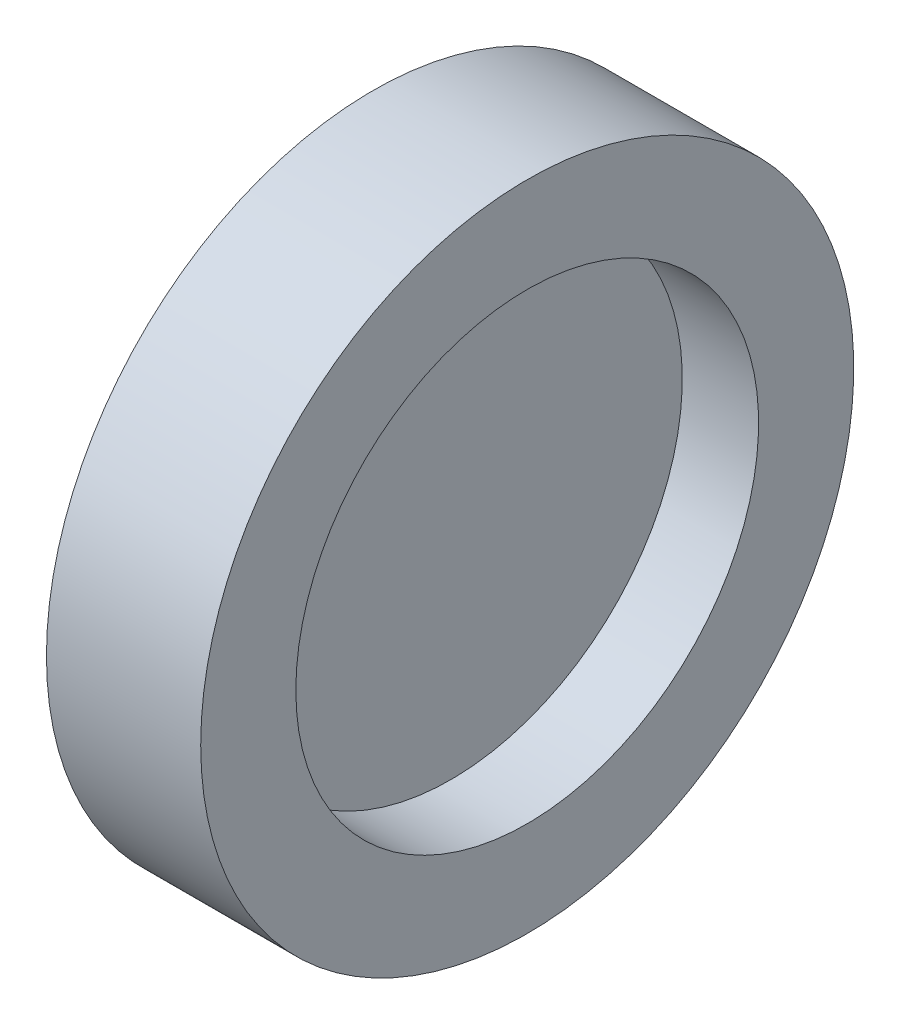
ISO-10303-21;
HEADER;
FILE_DESCRIPTION(('STEP AP214'),'2;1');
FILE_NAME('part.step','',(''),(''),'','','');
FILE_SCHEMA(('AUTOMOTIVE_DESIGN { 1 0 10303 214 1 1 1 1 }'));
ENDSEC;
DATA;
#1=APPLICATION_CONTEXT('core data for automotive mechanical design processes');
#2=APPLICATION_PROTOCOL_DEFINITION('international standard','automotive_design',2000,#1);
#3=PRODUCT_CONTEXT('',#1,'mechanical');
#4=PRODUCT('Part','Part','',(#3));
#5=PRODUCT_RELATED_PRODUCT_CATEGORY('part','',(#4));
#6=PRODUCT_DEFINITION_FORMATION('','',#4);
#7=PRODUCT_DEFINITION_CONTEXT('part definition',#1,'design');
#8=PRODUCT_DEFINITION('design','',#6,#7);
#9=PRODUCT_DEFINITION_SHAPE('','',#8);
#10=(LENGTH_UNIT() NAMED_UNIT(*) SI_UNIT(.MILLI.,.METRE.));
#11=(NAMED_UNIT(*) PLANE_ANGLE_UNIT() SI_UNIT($,.RADIAN.));
#12=(NAMED_UNIT(*) SI_UNIT($,.STERADIAN.) SOLID_ANGLE_UNIT());
#13=UNCERTAINTY_MEASURE_WITH_UNIT(LENGTH_MEASURE(1.E-05),#10,'distance_accuracy_value','');
#14=(GEOMETRIC_REPRESENTATION_CONTEXT(3) GLOBAL_UNCERTAINTY_ASSIGNED_CONTEXT((#13)) GLOBAL_UNIT_ASSIGNED_CONTEXT((#10,
#11,#12)) REPRESENTATION_CONTEXT('',''));
#15=CARTESIAN_POINT('',(0.,0.,0.));
#16=DIRECTION('',(0.,0.,1.));
#17=DIRECTION('',(1.,0.,0.));
#18=AXIS2_PLACEMENT_3D('',#15,#16,#17);
#19=CARTESIAN_POINT('',(0.0305000000000005,9.,0.));
#20=DIRECTION('',(-1.,0.,0.));
#21=DIRECTION('',(0.,0.,1.));
#22=AXIS2_PLACEMENT_3D('',#19,#20,#21);
#23=PLANE('',#22);
#24=CARTESIAN_POINT('',(0.0305000000000011,0.,0.));
#25=DIRECTION('',(-1.,0.,0.));
#26=DIRECTION('',(0.,0.,1.));
#27=AXIS2_PLACEMENT_3D('',#24,#25,#26);
#28=CIRCLE('',#27,9.);
#29=CARTESIAN_POINT('',(0.0305000000000011,0.,9.));
#30=VERTEX_POINT('',#29);
#31=EDGE_CURVE('E10',#30,#30,#28,.T.);
#32=ORIENTED_EDGE('',*,*,#31,.F.);
#33=EDGE_LOOP('',(#32));
#34=FACE_BOUND('',#33,.T.);
#35=ADVANCED_FACE('F37',(#34),#23,.F.);
#36=CARTESIAN_POINT('',(-1.61421241885762,0.,0.));
#37=DIRECTION('',(-1.,0.,0.));
#38=DIRECTION('',(0.,0.,1.));
#39=AXIS2_PLACEMENT_3D('',#36,#37,#38);
#40=CYLINDRICAL_SURFACE('',#39,9.);
#41=CARTESIAN_POINT('',(3.,0.,0.));
#42=DIRECTION('',(-1.,0.,0.));
#43=DIRECTION('',(0.,0.,1.));
#44=AXIS2_PLACEMENT_3D('',#41,#42,#43);
#45=CIRCLE('',#44,9.);
#46=CARTESIAN_POINT('',(3.,0.,9.));
#47=VERTEX_POINT('',#46);
#48=EDGE_CURVE('E60',#47,#47,#45,.T.);
#49=ORIENTED_EDGE('',*,*,#48,.F.);
#50=EDGE_LOOP('',(#49));
#51=FACE_BOUND('',#50,.T.);
#52=ORIENTED_EDGE('',*,*,#31,.T.);
#53=EDGE_LOOP('',(#52));
#54=FACE_BOUND('',#53,.T.);
#55=ADVANCED_FACE('F90',(#51,#54),#40,.F.);
#56=CARTESIAN_POINT('',(-3.,0.,0.));
#57=DIRECTION('',(-1.,0.,0.));
#58=DIRECTION('',(0.,0.,1.));
#59=AXIS2_PLACEMENT_3D('',#56,#57,#58);
#60=CIRCLE('',#59,9.);
#61=CARTESIAN_POINT('',(-3.,0.,9.));
#62=VERTEX_POINT('',#61);
#63=EDGE_CURVE('E64',#62,#62,#60,.T.);
#64=ORIENTED_EDGE('',*,*,#63,.T.);
#65=EDGE_LOOP('',(#64));
#66=FACE_BOUND('',#65,.T.);
#67=CARTESIAN_POINT('',(-0.0305000000000006,0.,0.));
#68=DIRECTION('',(1.,0.,0.));
#69=DIRECTION('',(0.,0.,-1.));
#70=AXIS2_PLACEMENT_3D('',#67,#68,#69);
#71=CIRCLE('',#70,9.);
#72=CARTESIAN_POINT('',(-0.0305000000000006,0.,-9.));
#73=VERTEX_POINT('',#72);
#74=EDGE_CURVE('E44',#73,#73,#71,.T.);
#75=ORIENTED_EDGE('',*,*,#74,.T.);
#76=EDGE_LOOP('',(#75));
#77=FACE_BOUND('',#76,.T.);
#78=ADVANCED_FACE('F69',(#66,#77),#40,.F.);
#79=CARTESIAN_POINT('',(-3.,9.,0.));
#80=DIRECTION('',(1.,0.,0.));
#81=DIRECTION('',(0.,0.,-1.));
#82=AXIS2_PLACEMENT_3D('',#79,#80,#81);
#83=PLANE('',#82);
#84=ORIENTED_EDGE('',*,*,#63,.F.);
#85=EDGE_LOOP('',(#84));
#86=FACE_BOUND('',#85,.T.);
#87=CARTESIAN_POINT('',(-3.,0.,0.));
#88=DIRECTION('',(-1.,0.,0.));
#89=DIRECTION('',(0.,0.,1.));
#90=AXIS2_PLACEMENT_3D('',#87,#88,#89);
#91=CIRCLE('',#90,12.7);
#92=CARTESIAN_POINT('',(-3.,0.,12.7));
#93=VERTEX_POINT('',#92);
#94=EDGE_CURVE('E49',#93,#93,#91,.T.);
#95=ORIENTED_EDGE('',*,*,#94,.T.);
#96=EDGE_LOOP('',(#95));
#97=FACE_BOUND('',#96,.T.);
#98=ADVANCED_FACE('F71',(#86,#97),#83,.F.);
#99=CARTESIAN_POINT('',(-1.61421241885762,0.,0.));
#100=DIRECTION('',(-1.,0.,0.));
#101=DIRECTION('',(0.,0.,1.));
#102=AXIS2_PLACEMENT_3D('',#99,#100,#101);
#103=CYLINDRICAL_SURFACE('',#102,12.7);
#104=ORIENTED_EDGE('',*,*,#94,.F.);
#105=EDGE_LOOP('',(#104));
#106=FACE_BOUND('',#105,.T.);
#107=CARTESIAN_POINT('',(3.,0.,0.));
#108=DIRECTION('',(-1.,0.,0.));
#109=DIRECTION('',(0.,0.,1.));
#110=AXIS2_PLACEMENT_3D('',#107,#108,#109);
#111=CIRCLE('',#110,12.7);
#112=CARTESIAN_POINT('',(3.,0.,12.7));
#113=VERTEX_POINT('',#112);
#114=EDGE_CURVE('E54',#113,#113,#111,.T.);
#115=ORIENTED_EDGE('',*,*,#114,.T.);
#116=EDGE_LOOP('',(#115));
#117=FACE_BOUND('',#116,.T.);
#118=ADVANCED_FACE('F74',(#106,#117),#103,.T.);
#119=CARTESIAN_POINT('',(3.,12.7,0.));
#120=DIRECTION('',(-1.,0.,0.));
#121=DIRECTION('',(0.,0.,1.));
#122=AXIS2_PLACEMENT_3D('',#119,#120,#121);
#123=PLANE('',#122);
#124=ORIENTED_EDGE('',*,*,#114,.F.);
#125=EDGE_LOOP('',(#124));
#126=FACE_BOUND('',#125,.T.);
#127=ORIENTED_EDGE('',*,*,#48,.T.);
#128=EDGE_LOOP('',(#127));
#129=FACE_BOUND('',#128,.T.);
#130=ADVANCED_FACE('F80',(#126,#129),#123,.F.);
#131=CARTESIAN_POINT('',(-0.0305000000000005,9.,0.));
#132=DIRECTION('',(1.,0.,0.));
#133=DIRECTION('',(0.,0.,-1.));
#134=AXIS2_PLACEMENT_3D('',#131,#132,#133);
#135=PLANE('',#134);
#136=ORIENTED_EDGE('',*,*,#74,.F.);
#137=EDGE_LOOP('',(#136));
#138=FACE_BOUND('',#137,.T.);
#139=ADVANCED_FACE('F86',(#138),#135,.F.);
#140=CLOSED_SHELL('',(#35,#55,#78,#98,#118,#130,#139));
#141=MANIFOLD_SOLID_BREP('B2',#140);
#142=ADVANCED_BREP_SHAPE_REPRESENTATION('',(#18,#141),#14);
#143=SHAPE_DEFINITION_REPRESENTATION(#9,#142);
ENDSEC;
END-ISO-10303-21;
